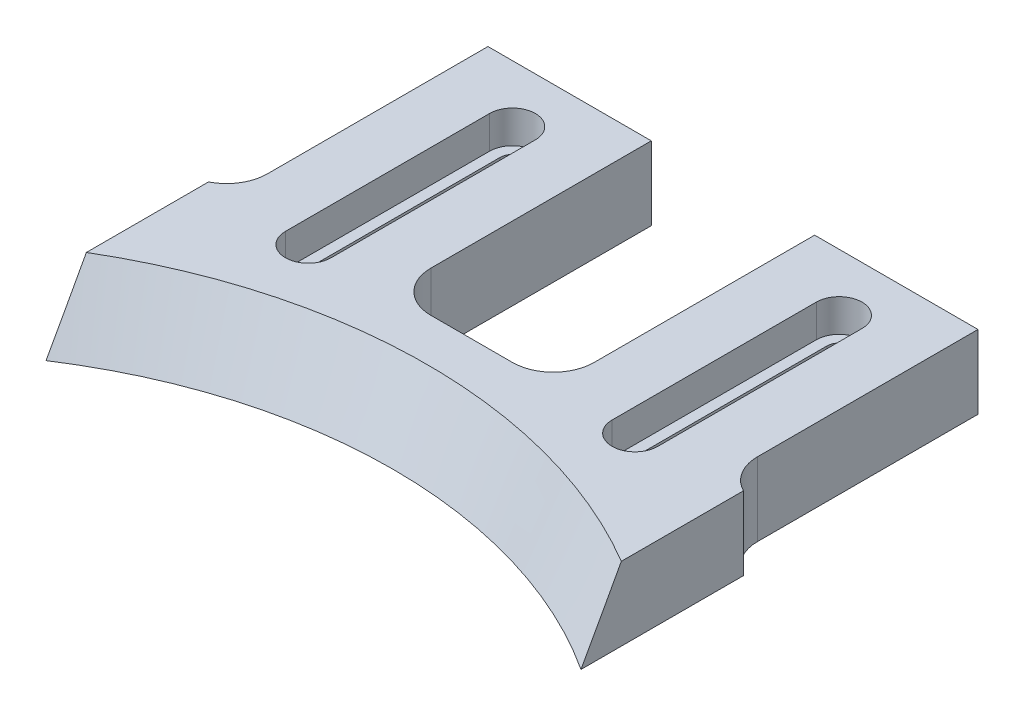
ISO-10303-21;
HEADER;
FILE_DESCRIPTION(('STEP AP214'),'2;1');
FILE_NAME('part.step','',(''),(''),'','','');
FILE_SCHEMA(('AUTOMOTIVE_DESIGN { 1 0 10303 214 1 1 1 1 }'));
ENDSEC;
DATA;
#1=APPLICATION_CONTEXT('core data for automotive mechanical design processes');
#2=APPLICATION_PROTOCOL_DEFINITION('international standard','automotive_design',2000,#1);
#3=PRODUCT_CONTEXT('',#1,'mechanical');
#4=PRODUCT('Part','Part','',(#3));
#5=PRODUCT_RELATED_PRODUCT_CATEGORY('part','',(#4));
#6=PRODUCT_DEFINITION_FORMATION('','',#4);
#7=PRODUCT_DEFINITION_CONTEXT('part definition',#1,'design');
#8=PRODUCT_DEFINITION('design','',#6,#7);
#9=PRODUCT_DEFINITION_SHAPE('','',#8);
#10=(LENGTH_UNIT() NAMED_UNIT(*) SI_UNIT(.MILLI.,.METRE.));
#11=(NAMED_UNIT(*) PLANE_ANGLE_UNIT() SI_UNIT($,.RADIAN.));
#12=(NAMED_UNIT(*) SI_UNIT($,.STERADIAN.) SOLID_ANGLE_UNIT());
#13=UNCERTAINTY_MEASURE_WITH_UNIT(LENGTH_MEASURE(1.E-05),#10,'distance_accuracy_value','');
#14=(GEOMETRIC_REPRESENTATION_CONTEXT(3) GLOBAL_UNCERTAINTY_ASSIGNED_CONTEXT((#13)) GLOBAL_UNIT_ASSIGNED_CONTEXT((#10,
#11,#12)) REPRESENTATION_CONTEXT('',''));
#15=CARTESIAN_POINT('',(0.,0.,0.));
#16=DIRECTION('',(0.,0.,1.));
#17=DIRECTION('',(1.,0.,0.));
#18=AXIS2_PLACEMENT_3D('',#15,#16,#17);
#19=CARTESIAN_POINT('',(57.75,-0.000999999999999265,-48.));
#20=DIRECTION('',(0.,1.,0.));
#21=DIRECTION('',(0.,0.,1.));
#22=AXIS2_PLACEMENT_3D('',#19,#20,#21);
#23=CYLINDRICAL_SURFACE('',#22,1.5);
#24=CARTESIAN_POINT('',(57.75,5.,-48.));
#25=DIRECTION('',(0.,1.,0.));
#26=DIRECTION('',(0.,0.,1.));
#27=AXIS2_PLACEMENT_3D('',#24,#25,#26);
#28=CIRCLE('',#27,1.5);
#29=CARTESIAN_POINT('',(56.25,5.,-48.));
#30=VERTEX_POINT('',#29);
#31=CARTESIAN_POINT('',(59.25,5.,-48.));
#32=VERTEX_POINT('',#31);
#33=EDGE_CURVE('E314',#30,#32,#28,.F.);
#34=ORIENTED_EDGE('',*,*,#33,.F.);
#35=DIRECTION('',(0.,1.,0.));
#36=VECTOR('',#35,1.);
#37=CARTESIAN_POINT('',(56.25,-0.000999999999999265,-48.));
#38=LINE('',#37,#36);
#39=CARTESIAN_POINT('',(56.25,0.,-48.));
#40=VERTEX_POINT('',#39);
#41=EDGE_CURVE('E324',#40,#30,#38,.T.);
#42=ORIENTED_EDGE('',*,*,#41,.F.);
#43=CARTESIAN_POINT('',(57.75,0.,-48.));
#44=DIRECTION('',(0.,-1.,0.));
#45=DIRECTION('',(0.,0.,-1.));
#46=AXIS2_PLACEMENT_3D('',#43,#44,#45);
#47=CIRCLE('',#46,1.5);
#48=CARTESIAN_POINT('',(59.25,0.,-48.));
#49=VERTEX_POINT('',#48);
#50=EDGE_CURVE('E335',#49,#40,#47,.F.);
#51=ORIENTED_EDGE('',*,*,#50,.F.);
#52=DIRECTION('',(0.,1.,0.));
#53=VECTOR('',#52,1.);
#54=CARTESIAN_POINT('',(59.25,-0.000999999999999265,-48.));
#55=LINE('',#54,#53);
#56=EDGE_CURVE('E327',#49,#32,#55,.T.);
#57=ORIENTED_EDGE('',*,*,#56,.T.);
#58=EDGE_LOOP('',(#34,#42,#51,#57));
#59=FACE_BOUND('',#58,.T.);
#60=ADVANCED_FACE('F37',(#59),#23,.F.);
#61=CARTESIAN_POINT('',(59.25,-0.000999999999999265,-48.));
#62=DIRECTION('',(1.,0.,0.));
#63=DIRECTION('',(0.,0.,-1.));
#64=AXIS2_PLACEMENT_3D('',#61,#62,#63);
#65=PLANE('',#64);
#66=DIRECTION('',(0.,0.,1.));
#67=VECTOR('',#66,1.);
#68=CARTESIAN_POINT('',(59.25,5.,-48.));
#69=LINE('',#68,#67);
#70=CARTESIAN_POINT('',(59.25,5.,-23.));
#71=VERTEX_POINT('',#70);
#72=EDGE_CURVE('E329',#32,#71,#69,.T.);
#73=ORIENTED_EDGE('',*,*,#72,.F.);
#74=ORIENTED_EDGE('',*,*,#56,.F.);
#75=DIRECTION('',(0.,0.,-1.));
#76=VECTOR('',#75,1.);
#77=CARTESIAN_POINT('',(59.25,0.,-48.));
#78=LINE('',#77,#76);
#79=CARTESIAN_POINT('',(59.25,0.,-23.));
#80=VERTEX_POINT('',#79);
#81=EDGE_CURVE('E339',#80,#49,#78,.T.);
#82=ORIENTED_EDGE('',*,*,#81,.F.);
#83=DIRECTION('',(0.,1.,0.));
#84=VECTOR('',#83,1.);
#85=CARTESIAN_POINT('',(59.25,-0.000999999999999265,-23.));
#86=LINE('',#85,#84);
#87=EDGE_CURVE('E337',#80,#71,#86,.T.);
#88=ORIENTED_EDGE('',*,*,#87,.T.);
#89=EDGE_LOOP('',(#73,#74,#82,#88));
#90=FACE_BOUND('',#89,.T.);
#91=ADVANCED_FACE('F425',(#90),#65,.F.);
#92=CARTESIAN_POINT('',(57.75,-0.000999999999999265,-23.));
#93=DIRECTION('',(0.,1.,0.));
#94=DIRECTION('',(0.,0.,1.));
#95=AXIS2_PLACEMENT_3D('',#92,#93,#94);
#96=CYLINDRICAL_SURFACE('',#95,1.49999999999999);
#97=CARTESIAN_POINT('',(57.75,5.,-23.));
#98=DIRECTION('',(0.,1.,0.));
#99=DIRECTION('',(0.,0.,1.));
#100=AXIS2_PLACEMENT_3D('',#97,#98,#99);
#101=CIRCLE('',#100,1.49999999999999);
#102=CARTESIAN_POINT('',(56.25,5.,-23.));
#103=VERTEX_POINT('',#102);
#104=EDGE_CURVE('E317',#71,#103,#101,.F.);
#105=ORIENTED_EDGE('',*,*,#104,.F.);
#106=ORIENTED_EDGE('',*,*,#87,.F.);
#107=CARTESIAN_POINT('',(57.75,0.,-23.));
#108=DIRECTION('',(0.,-1.,0.));
#109=DIRECTION('',(0.,0.,-1.));
#110=AXIS2_PLACEMENT_3D('',#107,#108,#109);
#111=CIRCLE('',#110,1.49999999999999);
#112=CARTESIAN_POINT('',(56.25,0.,-23.));
#113=VERTEX_POINT('',#112);
#114=EDGE_CURVE('E415',#113,#80,#111,.F.);
#115=ORIENTED_EDGE('',*,*,#114,.F.);
#116=DIRECTION('',(0.,1.,0.));
#117=VECTOR('',#116,1.);
#118=CARTESIAN_POINT('',(56.25,-0.000999999999999265,-23.));
#119=LINE('',#118,#117);
#120=EDGE_CURVE('E334',#113,#103,#119,.T.);
#121=ORIENTED_EDGE('',*,*,#120,.T.);
#122=EDGE_LOOP('',(#105,#106,#115,#121));
#123=FACE_BOUND('',#122,.T.);
#124=ADVANCED_FACE('F428',(#123),#96,.F.);
#125=CARTESIAN_POINT('',(56.25,-0.000999999999999265,-48.));
#126=DIRECTION('',(-1.,0.,0.));
#127=DIRECTION('',(0.,0.,1.));
#128=AXIS2_PLACEMENT_3D('',#125,#126,#127);
#129=PLANE('',#128);
#130=DIRECTION('',(0.,0.,-1.));
#131=VECTOR('',#130,1.);
#132=CARTESIAN_POINT('',(56.25,5.,-48.));
#133=LINE('',#132,#131);
#134=EDGE_CURVE('E45',#103,#30,#133,.T.);
#135=ORIENTED_EDGE('',*,*,#134,.F.);
#136=ORIENTED_EDGE('',*,*,#120,.F.);
#137=DIRECTION('',(0.,0.,1.));
#138=VECTOR('',#137,1.);
#139=CARTESIAN_POINT('',(56.25,0.,-48.));
#140=LINE('',#139,#138);
#141=EDGE_CURVE('E333',#40,#113,#140,.T.);
#142=ORIENTED_EDGE('',*,*,#141,.F.);
#143=ORIENTED_EDGE('',*,*,#41,.T.);
#144=EDGE_LOOP('',(#135,#136,#142,#143));
#145=FACE_BOUND('',#144,.T.);
#146=ADVANCED_FACE('F331',(#145),#129,.F.);
#147=CARTESIAN_POINT('',(17.75,-0.000999999999999265,-48.));
#148=DIRECTION('',(0.,1.,0.));
#149=DIRECTION('',(0.,0.,1.));
#150=AXIS2_PLACEMENT_3D('',#147,#148,#149);
#151=CYLINDRICAL_SURFACE('',#150,1.5);
#152=CARTESIAN_POINT('',(17.75,5.,-48.));
#153=DIRECTION('',(0.,1.,0.));
#154=DIRECTION('',(0.,0.,1.));
#155=AXIS2_PLACEMENT_3D('',#152,#153,#154);
#156=CIRCLE('',#155,1.5);
#157=CARTESIAN_POINT('',(16.25,5.,-48.));
#158=VERTEX_POINT('',#157);
#159=CARTESIAN_POINT('',(19.25,5.,-48.));
#160=VERTEX_POINT('',#159);
#161=EDGE_CURVE('E371',#158,#160,#156,.F.);
#162=ORIENTED_EDGE('',*,*,#161,.F.);
#163=DIRECTION('',(0.,1.,0.));
#164=VECTOR('',#163,1.);
#165=CARTESIAN_POINT('',(16.25,-0.000999999999999265,-48.));
#166=LINE('',#165,#164);
#167=CARTESIAN_POINT('',(16.25,0.,-48.));
#168=VERTEX_POINT('',#167);
#169=EDGE_CURVE('E353',#168,#158,#166,.T.);
#170=ORIENTED_EDGE('',*,*,#169,.F.);
#171=CARTESIAN_POINT('',(17.75,0.,-48.));
#172=DIRECTION('',(0.,-1.,0.));
#173=DIRECTION('',(0.,0.,-1.));
#174=AXIS2_PLACEMENT_3D('',#171,#172,#173);
#175=CIRCLE('',#174,1.5);
#176=CARTESIAN_POINT('',(19.25,0.,-48.));
#177=VERTEX_POINT('',#176);
#178=EDGE_CURVE('E350',#177,#168,#175,.F.);
#179=ORIENTED_EDGE('',*,*,#178,.F.);
#180=DIRECTION('',(0.,1.,0.));
#181=VECTOR('',#180,1.);
#182=CARTESIAN_POINT('',(19.25,-0.000999999999999265,-48.));
#183=LINE('',#182,#181);
#184=EDGE_CURVE('E259',#177,#160,#183,.T.);
#185=ORIENTED_EDGE('',*,*,#184,.T.);
#186=EDGE_LOOP('',(#162,#170,#179,#185));
#187=FACE_BOUND('',#186,.T.);
#188=ADVANCED_FACE('F369',(#187),#151,.F.);
#189=CARTESIAN_POINT('',(19.25,-0.000999999999999265,-48.));
#190=DIRECTION('',(1.,0.,0.));
#191=DIRECTION('',(0.,0.,-1.));
#192=AXIS2_PLACEMENT_3D('',#189,#190,#191);
#193=PLANE('',#192);
#194=DIRECTION('',(0.,0.,1.));
#195=VECTOR('',#194,1.);
#196=CARTESIAN_POINT('',(19.25,5.,-48.));
#197=LINE('',#196,#195);
#198=CARTESIAN_POINT('',(19.25,5.,-23.));
#199=VERTEX_POINT('',#198);
#200=EDGE_CURVE('E383',#160,#199,#197,.T.);
#201=ORIENTED_EDGE('',*,*,#200,.F.);
#202=ORIENTED_EDGE('',*,*,#184,.F.);
#203=DIRECTION('',(0.,0.,-1.));
#204=VECTOR('',#203,1.);
#205=CARTESIAN_POINT('',(19.25,0.,-48.));
#206=LINE('',#205,#204);
#207=CARTESIAN_POINT('',(19.25,0.,-23.));
#208=VERTEX_POINT('',#207);
#209=EDGE_CURVE('E347',#208,#177,#206,.T.);
#210=ORIENTED_EDGE('',*,*,#209,.F.);
#211=DIRECTION('',(0.,1.,0.));
#212=VECTOR('',#211,1.);
#213=CARTESIAN_POINT('',(19.25,-0.000999999999999265,-23.));
#214=LINE('',#213,#212);
#215=EDGE_CURVE('E356',#208,#199,#214,.T.);
#216=ORIENTED_EDGE('',*,*,#215,.T.);
#217=EDGE_LOOP('',(#201,#202,#210,#216));
#218=FACE_BOUND('',#217,.T.);
#219=ADVANCED_FACE('F377',(#218),#193,.F.);
#220=CARTESIAN_POINT('',(17.75,-0.000999999999999265,-23.));
#221=DIRECTION('',(0.,1.,0.));
#222=DIRECTION('',(0.,0.,1.));
#223=AXIS2_PLACEMENT_3D('',#220,#221,#222);
#224=CYLINDRICAL_SURFACE('',#223,1.5);
#225=CARTESIAN_POINT('',(17.75,5.,-23.));
#226=DIRECTION('',(0.,1.,0.));
#227=DIRECTION('',(0.,0.,1.));
#228=AXIS2_PLACEMENT_3D('',#225,#226,#227);
#229=CIRCLE('',#228,1.5);
#230=CARTESIAN_POINT('',(16.25,5.,-23.));
#231=VERTEX_POINT('',#230);
#232=EDGE_CURVE('E381',#199,#231,#229,.F.);
#233=ORIENTED_EDGE('',*,*,#232,.F.);
#234=ORIENTED_EDGE('',*,*,#215,.F.);
#235=CARTESIAN_POINT('',(17.75,0.,-23.));
#236=DIRECTION('',(0.,-1.,0.));
#237=DIRECTION('',(0.,0.,-1.));
#238=AXIS2_PLACEMENT_3D('',#235,#236,#237);
#239=CIRCLE('',#238,1.5);
#240=CARTESIAN_POINT('',(16.25,0.,-23.));
#241=VERTEX_POINT('',#240);
#242=EDGE_CURVE('E344',#241,#208,#239,.F.);
#243=ORIENTED_EDGE('',*,*,#242,.F.);
#244=DIRECTION('',(0.,1.,0.));
#245=VECTOR('',#244,1.);
#246=CARTESIAN_POINT('',(16.25,-0.000999999999999265,-23.));
#247=LINE('',#246,#245);
#248=EDGE_CURVE('E359',#241,#231,#247,.T.);
#249=ORIENTED_EDGE('',*,*,#248,.T.);
#250=EDGE_LOOP('',(#233,#234,#243,#249));
#251=FACE_BOUND('',#250,.T.);
#252=ADVANCED_FACE('F380',(#251),#224,.F.);
#253=CARTESIAN_POINT('',(16.25,-0.000999999999999265,-48.));
#254=DIRECTION('',(-1.,0.,0.));
#255=DIRECTION('',(0.,0.,1.));
#256=AXIS2_PLACEMENT_3D('',#253,#254,#255);
#257=PLANE('',#256);
#258=DIRECTION('',(0.,0.,-1.));
#259=VECTOR('',#258,1.);
#260=CARTESIAN_POINT('',(16.25,5.,-48.));
#261=LINE('',#260,#259);
#262=EDGE_CURVE('E309',#231,#158,#261,.T.);
#263=ORIENTED_EDGE('',*,*,#262,.F.);
#264=ORIENTED_EDGE('',*,*,#248,.F.);
#265=DIRECTION('',(0.,0.,1.));
#266=VECTOR('',#265,1.);
#267=CARTESIAN_POINT('',(16.25,0.,-48.));
#268=LINE('',#267,#266);
#269=EDGE_CURVE('E253',#168,#241,#268,.T.);
#270=ORIENTED_EDGE('',*,*,#269,.F.);
#271=ORIENTED_EDGE('',*,*,#169,.T.);
#272=EDGE_LOOP('',(#263,#264,#270,#271));
#273=FACE_BOUND('',#272,.T.);
#274=ADVANCED_FACE('F366',(#273),#257,.F.);
#275=CARTESIAN_POINT('',(0.,9.,-55.));
#276=DIRECTION('',(0.,0.,1.));
#277=DIRECTION('',(1.,0.,0.));
#278=AXIS2_PLACEMENT_3D('',#275,#276,#277);
#279=PLANE('',#278);
#280=DIRECTION('',(-1.,0.,0.));
#281=VECTOR('',#280,1.);
#282=CARTESIAN_POINT('',(0.,0.,-55.));
#283=LINE('',#282,#281);
#284=CARTESIAN_POINT('',(27.75,0.,-55.));
#285=VERTEX_POINT('',#284);
#286=CARTESIAN_POINT('',(7.74999999999998,0.,-55.));
#287=VERTEX_POINT('',#286);
#288=EDGE_CURVE('E252',#285,#287,#283,.T.);
#289=ORIENTED_EDGE('',*,*,#288,.T.);
#290=DIRECTION('',(0.,1.,0.));
#291=VECTOR('',#290,1.);
#292=CARTESIAN_POINT('',(7.74999999999998,-1.,-55.));
#293=LINE('',#292,#291);
#294=CARTESIAN_POINT('',(7.74999999999998,9.,-55.));
#295=VERTEX_POINT('',#294);
#296=EDGE_CURVE('E401',#287,#295,#293,.T.);
#297=ORIENTED_EDGE('',*,*,#296,.T.);
#298=DIRECTION('',(-1.,0.,0.));
#299=VECTOR('',#298,1.);
#300=CARTESIAN_POINT('',(0.,9.,-55.));
#301=LINE('',#300,#299);
#302=CARTESIAN_POINT('',(27.75,9.,-55.));
#303=VERTEX_POINT('',#302);
#304=EDGE_CURVE('E264',#303,#295,#301,.T.);
#305=ORIENTED_EDGE('',*,*,#304,.F.);
#306=DIRECTION('',(0.,1.,0.));
#307=VECTOR('',#306,1.);
#308=CARTESIAN_POINT('',(27.75,-1.,-55.));
#309=LINE('',#308,#307);
#310=EDGE_CURVE('E413',#285,#303,#309,.T.);
#311=ORIENTED_EDGE('',*,*,#310,.F.);
#312=EDGE_LOOP('',(#289,#297,#305,#311));
#313=FACE_BOUND('',#312,.T.);
#314=ADVANCED_FACE('F459',(#313),#279,.F.);
#315=CARTESIAN_POINT('',(67.75,9.,-55.));
#316=VERTEX_POINT('',#315);
#317=CARTESIAN_POINT('',(47.75,9.,-55.));
#318=VERTEX_POINT('',#317);
#319=EDGE_CURVE('E262',#316,#318,#301,.T.);
#320=ORIENTED_EDGE('',*,*,#319,.F.);
#321=DIRECTION('',(0.,1.,0.));
#322=VECTOR('',#321,1.);
#323=CARTESIAN_POINT('',(67.75,-1.,-55.));
#324=LINE('',#323,#322);
#325=CARTESIAN_POINT('',(67.75,0.,-55.));
#326=VERTEX_POINT('',#325);
#327=EDGE_CURVE('E397',#326,#316,#324,.T.);
#328=ORIENTED_EDGE('',*,*,#327,.F.);
#329=CARTESIAN_POINT('',(47.75,0.,-55.));
#330=VERTEX_POINT('',#329);
#331=EDGE_CURVE('E256',#326,#330,#283,.T.);
#332=ORIENTED_EDGE('',*,*,#331,.T.);
#333=DIRECTION('',(0.,1.,0.));
#334=VECTOR('',#333,1.);
#335=CARTESIAN_POINT('',(47.75,-1.,-55.));
#336=LINE('',#335,#334);
#337=EDGE_CURVE('E412',#330,#318,#336,.T.);
#338=ORIENTED_EDGE('',*,*,#337,.T.);
#339=EDGE_LOOP('',(#320,#328,#332,#338));
#340=FACE_BOUND('',#339,.T.);
#341=ADVANCED_FACE('F440',(#340),#279,.F.);
#342=CARTESIAN_POINT('',(37.75,9.,46.636225190296));
#343=DIRECTION('',(0.,-1.,0.));
#344=DIRECTION('',(0.,0.,-1.));
#345=AXIS2_PLACEMENT_3D('',#342,#343,#344);
#346=PLANE('',#345);
#347=DIRECTION('',(0.,0.,1.));
#348=VECTOR('',#347,1.);
#349=CARTESIAN_POINT('',(54.95,9.,-48.));
#350=LINE('',#349,#348);
#351=CARTESIAN_POINT('',(54.95,9.,-48.));
#352=VERTEX_POINT('',#351);
#353=CARTESIAN_POINT('',(54.95,9.,-23.));
#354=VERTEX_POINT('',#353);
#355=EDGE_CURVE('E559',#352,#354,#350,.T.);
#356=ORIENTED_EDGE('',*,*,#355,.F.);
#357=CARTESIAN_POINT('',(57.75,9.,-48.));
#358=DIRECTION('',(0.,1.,0.));
#359=DIRECTION('',(0.,0.,1.));
#360=AXIS2_PLACEMENT_3D('',#357,#358,#359);
#361=CIRCLE('',#360,2.8);
#362=CARTESIAN_POINT('',(60.55,9.,-48.));
#363=VERTEX_POINT('',#362);
#364=EDGE_CURVE('E543',#363,#352,#361,.T.);
#365=ORIENTED_EDGE('',*,*,#364,.F.);
#366=DIRECTION('',(0.,0.,-1.));
#367=VECTOR('',#366,1.);
#368=CARTESIAN_POINT('',(60.55,9.,-48.));
#369=LINE('',#368,#367);
#370=CARTESIAN_POINT('',(60.55,9.,-23.));
#371=VERTEX_POINT('',#370);
#372=EDGE_CURVE('E548',#371,#363,#369,.T.);
#373=ORIENTED_EDGE('',*,*,#372,.F.);
#374=CARTESIAN_POINT('',(57.75,9.,-23.));
#375=DIRECTION('',(0.,1.,0.));
#376=DIRECTION('',(0.,0.,1.));
#377=AXIS2_PLACEMENT_3D('',#374,#375,#376);
#378=CIRCLE('',#377,2.79999999999999);
#379=EDGE_CURVE('E562',#354,#371,#378,.T.);
#380=ORIENTED_EDGE('',*,*,#379,.F.);
#381=EDGE_LOOP('',(#356,#365,#373,#380));
#382=FACE_BOUND('',#381,.T.);
#383=DIRECTION('',(0.,0.,1.));
#384=VECTOR('',#383,1.);
#385=CARTESIAN_POINT('',(14.95,9.,-48.));
#386=LINE('',#385,#384);
#387=CARTESIAN_POINT('',(14.95,9.,-48.));
#388=VERTEX_POINT('',#387);
#389=CARTESIAN_POINT('',(14.95,9.,-23.));
#390=VERTEX_POINT('',#389);
#391=EDGE_CURVE('E591',#388,#390,#386,.T.);
#392=ORIENTED_EDGE('',*,*,#391,.F.);
#393=CARTESIAN_POINT('',(17.75,9.,-48.));
#394=DIRECTION('',(0.,1.,0.));
#395=DIRECTION('',(0.,0.,1.));
#396=AXIS2_PLACEMENT_3D('',#393,#394,#395);
#397=CIRCLE('',#396,2.8);
#398=CARTESIAN_POINT('',(20.55,9.,-48.));
#399=VERTEX_POINT('',#398);
#400=EDGE_CURVE('E328',#399,#388,#397,.T.);
#401=ORIENTED_EDGE('',*,*,#400,.F.);
#402=DIRECTION('',(0.,0.,-1.));
#403=VECTOR('',#402,1.);
#404=CARTESIAN_POINT('',(20.55,9.,-48.));
#405=LINE('',#404,#403);
#406=CARTESIAN_POINT('',(20.55,9.,-23.));
#407=VERTEX_POINT('',#406);
#408=EDGE_CURVE('E581',#407,#399,#405,.T.);
#409=ORIENTED_EDGE('',*,*,#408,.F.);
#410=CARTESIAN_POINT('',(17.75,9.,-23.));
#411=DIRECTION('',(0.,1.,0.));
#412=DIRECTION('',(0.,0.,1.));
#413=AXIS2_PLACEMENT_3D('',#410,#411,#412);
#414=CIRCLE('',#413,2.8);
#415=EDGE_CURVE('E594',#390,#407,#414,.T.);
#416=ORIENTED_EDGE('',*,*,#415,.F.);
#417=EDGE_LOOP('',(#392,#401,#409,#416));
#418=FACE_BOUND('',#417,.T.);
#419=CARTESIAN_POINT('',(37.75,9.,46.636225190296));
#420=DIRECTION('',(0.,-1.,0.));
#421=DIRECTION('',(0.,0.,-1.));
#422=AXIS2_PLACEMENT_3D('',#419,#420,#421);
#423=CIRCLE('',#422,64.196768923395);
#424=CARTESIAN_POINT('',(5.,9.,-8.57847068139897));
#425=VERTEX_POINT('',#424);
#426=CARTESIAN_POINT('',(70.5,9.,-8.57847068139898));
#427=VERTEX_POINT('',#426);
#428=EDGE_CURVE('E11',#425,#427,#423,.T.);
#429=ORIENTED_EDGE('',*,*,#428,.T.);
#430=DIRECTION('',(0.,0.,1.));
#431=VECTOR('',#430,1.);
#432=CARTESIAN_POINT('',(70.5,9.,0.));
#433=LINE('',#432,#431);
#434=CARTESIAN_POINT('',(70.5,9.,-23.5348572251271));
#435=VERTEX_POINT('',#434);
#436=EDGE_CURVE('E52',#435,#427,#433,.T.);
#437=ORIENTED_EDGE('',*,*,#436,.F.);
#438=CARTESIAN_POINT('',(72.75,9.,-28.));
#439=DIRECTION('',(0.,-1.,0.));
#440=DIRECTION('',(0.,0.,-1.));
#441=AXIS2_PLACEMENT_3D('',#438,#439,#440);
#442=CIRCLE('',#441,5.);
#443=CARTESIAN_POINT('',(67.75,9.,-28.));
#444=VERTEX_POINT('',#443);
#445=EDGE_CURVE('E293',#435,#444,#442,.T.);
#446=ORIENTED_EDGE('',*,*,#445,.T.);
#447=DIRECTION('',(0.,0.,1.));
#448=VECTOR('',#447,1.);
#449=CARTESIAN_POINT('',(67.75,9.,-55.));
#450=LINE('',#449,#448);
#451=EDGE_CURVE('E394',#316,#444,#450,.T.);
#452=ORIENTED_EDGE('',*,*,#451,.F.);
#453=ORIENTED_EDGE('',*,*,#319,.T.);
#454=DIRECTION('',(0.,0.,-1.));
#455=VECTOR('',#454,1.);
#456=CARTESIAN_POINT('',(47.75,9.,-55.));
#457=LINE('',#456,#455);
#458=CARTESIAN_POINT('',(47.75,9.,-28.));
#459=VERTEX_POINT('',#458);
#460=EDGE_CURVE('E410',#459,#318,#457,.T.);
#461=ORIENTED_EDGE('',*,*,#460,.F.);
#462=CARTESIAN_POINT('',(42.75,9.,-28.));
#463=DIRECTION('',(0.,-1.,0.));
#464=DIRECTION('',(0.,0.,-1.));
#465=AXIS2_PLACEMENT_3D('',#462,#463,#464);
#466=CIRCLE('',#465,5.);
#467=CARTESIAN_POINT('',(42.75,9.,-23.));
#468=VERTEX_POINT('',#467);
#469=EDGE_CURVE('E296',#459,#468,#466,.T.);
#470=ORIENTED_EDGE('',*,*,#469,.T.);
#471=DIRECTION('',(1.,0.,0.));
#472=VECTOR('',#471,1.);
#473=CARTESIAN_POINT('',(27.75,9.,-23.));
#474=LINE('',#473,#472);
#475=CARTESIAN_POINT('',(32.75,9.,-23.));
#476=VERTEX_POINT('',#475);
#477=EDGE_CURVE('E407',#476,#468,#474,.T.);
#478=ORIENTED_EDGE('',*,*,#477,.F.);
#479=CARTESIAN_POINT('',(32.75,9.,-28.));
#480=DIRECTION('',(0.,-1.,0.));
#481=DIRECTION('',(0.,0.,-1.));
#482=AXIS2_PLACEMENT_3D('',#479,#480,#481);
#483=CIRCLE('',#482,5.);
#484=CARTESIAN_POINT('',(27.75,9.,-28.));
#485=VERTEX_POINT('',#484);
#486=EDGE_CURVE('E300',#476,#485,#483,.T.);
#487=ORIENTED_EDGE('',*,*,#486,.T.);
#488=DIRECTION('',(0.,0.,1.));
#489=VECTOR('',#488,1.);
#490=CARTESIAN_POINT('',(27.75,9.,-55.));
#491=LINE('',#490,#489);
#492=EDGE_CURVE('E404',#303,#485,#491,.T.);
#493=ORIENTED_EDGE('',*,*,#492,.F.);
#494=ORIENTED_EDGE('',*,*,#304,.T.);
#495=DIRECTION('',(0.,0.,-1.));
#496=VECTOR('',#495,1.);
#497=CARTESIAN_POINT('',(7.74999999999998,9.,-55.));
#498=LINE('',#497,#496);
#499=CARTESIAN_POINT('',(7.74999999999998,9.,-28.));
#500=VERTEX_POINT('',#499);
#501=EDGE_CURVE('E399',#500,#295,#498,.T.);
#502=ORIENTED_EDGE('',*,*,#501,.F.);
#503=CARTESIAN_POINT('',(2.74999999999998,9.,-28.));
#504=DIRECTION('',(0.,-1.,0.));
#505=DIRECTION('',(0.,0.,-1.));
#506=AXIS2_PLACEMENT_3D('',#503,#504,#505);
#507=CIRCLE('',#506,5.);
#508=CARTESIAN_POINT('',(5.,9.,-23.5348572251271));
#509=VERTEX_POINT('',#508);
#510=EDGE_CURVE('E304',#500,#509,#507,.T.);
#511=ORIENTED_EDGE('',*,*,#510,.T.);
#512=DIRECTION('',(0.,0.,-1.));
#513=VECTOR('',#512,1.);
#514=CARTESIAN_POINT('',(5.,9.,0.));
#515=LINE('',#514,#513);
#516=EDGE_CURVE('E541',#425,#509,#515,.T.);
#517=ORIENTED_EDGE('',*,*,#516,.F.);
#518=EDGE_LOOP('',(#429,#437,#446,#452,#453,#461,#470,#478,#487,#493,#494,#502,#511,#517));
#519=FACE_BOUND('',#518,.T.);
#520=ADVANCED_FACE('F431',(#382,#418,#519),#346,.F.);
#521=CARTESIAN_POINT('',(37.75,0.,46.636225190296));
#522=DIRECTION('',(0.,-1.,0.));
#523=DIRECTION('',(0.,0.,-1.));
#524=AXIS2_PLACEMENT_3D('',#521,#522,#523);
#525=PLANE('',#524);
#526=DIRECTION('',(0.,0.,1.));
#527=VECTOR('',#526,1.);
#528=CARTESIAN_POINT('',(70.5,0.,0.));
#529=LINE('',#528,#527);
#530=CARTESIAN_POINT('',(70.5,0.,-23.5348572251271));
#531=VERTEX_POINT('',#530);
#532=CARTESIAN_POINT('',(70.5,0.,-3.63740109625707));
#533=VERTEX_POINT('',#532);
#534=EDGE_CURVE('E234',#531,#533,#529,.T.);
#535=ORIENTED_EDGE('',*,*,#534,.T.);
#536=CARTESIAN_POINT('',(37.75,0.,46.636225190296));
#537=DIRECTION('',(0.,-1.,0.));
#538=DIRECTION('',(0.,0.,-1.));
#539=AXIS2_PLACEMENT_3D('',#536,#537,#538);
#540=CIRCLE('',#539,60.);
#541=CARTESIAN_POINT('',(5.,0.,-3.63740109625706));
#542=VERTEX_POINT('',#541);
#543=EDGE_CURVE('E246',#542,#533,#540,.T.);
#544=ORIENTED_EDGE('',*,*,#543,.F.);
#545=DIRECTION('',(0.,0.,-1.));
#546=VECTOR('',#545,1.);
#547=CARTESIAN_POINT('',(5.,0.,0.));
#548=LINE('',#547,#546);
#549=CARTESIAN_POINT('',(5.,0.,-23.5348572251271));
#550=VERTEX_POINT('',#549);
#551=EDGE_CURVE('E60',#542,#550,#548,.T.);
#552=ORIENTED_EDGE('',*,*,#551,.T.);
#553=CARTESIAN_POINT('',(2.74999999999998,0.,-28.));
#554=DIRECTION('',(0.,-1.,0.));
#555=DIRECTION('',(0.,0.,-1.));
#556=AXIS2_PLACEMENT_3D('',#553,#554,#555);
#557=CIRCLE('',#556,5.);
#558=CARTESIAN_POINT('',(7.74999999999998,0.,-28.));
#559=VERTEX_POINT('',#558);
#560=EDGE_CURVE('E307',#550,#559,#557,.F.);
#561=ORIENTED_EDGE('',*,*,#560,.T.);
#562=DIRECTION('',(0.,0.,1.));
#563=VECTOR('',#562,1.);
#564=CARTESIAN_POINT('',(7.74999999999999,0.,46.636225190296));
#565=LINE('',#564,#563);
#566=EDGE_CURVE('E273',#287,#559,#565,.T.);
#567=ORIENTED_EDGE('',*,*,#566,.F.);
#568=ORIENTED_EDGE('',*,*,#288,.F.);
#569=DIRECTION('',(0.,0.,-1.));
#570=VECTOR('',#569,1.);
#571=CARTESIAN_POINT('',(27.75,0.,46.636225190296));
#572=LINE('',#571,#570);
#573=CARTESIAN_POINT('',(27.75,0.,-28.));
#574=VERTEX_POINT('',#573);
#575=EDGE_CURVE('E271',#574,#285,#572,.T.);
#576=ORIENTED_EDGE('',*,*,#575,.F.);
#577=CARTESIAN_POINT('',(32.75,0.,-28.));
#578=DIRECTION('',(0.,-1.,0.));
#579=DIRECTION('',(0.,0.,-1.));
#580=AXIS2_PLACEMENT_3D('',#577,#578,#579);
#581=CIRCLE('',#580,5.);
#582=CARTESIAN_POINT('',(32.75,0.,-23.));
#583=VERTEX_POINT('',#582);
#584=EDGE_CURVE('E302',#574,#583,#581,.F.);
#585=ORIENTED_EDGE('',*,*,#584,.T.);
#586=DIRECTION('',(-1.,0.,0.));
#587=VECTOR('',#586,1.);
#588=CARTESIAN_POINT('',(37.75,0.,-23.));
#589=LINE('',#588,#587);
#590=CARTESIAN_POINT('',(42.75,0.,-23.));
#591=VERTEX_POINT('',#590);
#592=EDGE_CURVE('E265',#591,#583,#589,.T.);
#593=ORIENTED_EDGE('',*,*,#592,.F.);
#594=CARTESIAN_POINT('',(42.75,0.,-28.));
#595=DIRECTION('',(0.,-1.,0.));
#596=DIRECTION('',(0.,0.,-1.));
#597=AXIS2_PLACEMENT_3D('',#594,#595,#596);
#598=CIRCLE('',#597,5.);
#599=CARTESIAN_POINT('',(47.75,0.,-28.));
#600=VERTEX_POINT('',#599);
#601=EDGE_CURVE('E298',#591,#600,#598,.F.);
#602=ORIENTED_EDGE('',*,*,#601,.T.);
#603=DIRECTION('',(0.,0.,1.));
#604=VECTOR('',#603,1.);
#605=CARTESIAN_POINT('',(47.75,0.,46.636225190296));
#606=LINE('',#605,#604);
#607=EDGE_CURVE('E268',#330,#600,#606,.T.);
#608=ORIENTED_EDGE('',*,*,#607,.F.);
#609=ORIENTED_EDGE('',*,*,#331,.F.);
#610=DIRECTION('',(0.,0.,-1.));
#611=VECTOR('',#610,1.);
#612=CARTESIAN_POINT('',(67.75,0.,46.636225190296));
#613=LINE('',#612,#611);
#614=CARTESIAN_POINT('',(67.75,0.,-28.));
#615=VERTEX_POINT('',#614);
#616=EDGE_CURVE('E276',#615,#326,#613,.T.);
#617=ORIENTED_EDGE('',*,*,#616,.F.);
#618=CARTESIAN_POINT('',(72.75,0.,-28.));
#619=DIRECTION('',(0.,-1.,0.));
#620=DIRECTION('',(0.,0.,-1.));
#621=AXIS2_PLACEMENT_3D('',#618,#619,#620);
#622=CIRCLE('',#621,5.);
#623=EDGE_CURVE('E249',#615,#531,#622,.F.);
#624=ORIENTED_EDGE('',*,*,#623,.T.);
#625=EDGE_LOOP('',(#535,#544,#552,#561,#567,#568,#576,#585,#593,#602,#608,#609,#617,#624));
#626=FACE_BOUND('',#625,.T.);
#627=ORIENTED_EDGE('',*,*,#50,.T.);
#628=ORIENTED_EDGE('',*,*,#141,.T.);
#629=ORIENTED_EDGE('',*,*,#114,.T.);
#630=ORIENTED_EDGE('',*,*,#81,.T.);
#631=EDGE_LOOP('',(#627,#628,#629,#630));
#632=FACE_BOUND('',#631,.T.);
#633=ORIENTED_EDGE('',*,*,#178,.T.);
#634=ORIENTED_EDGE('',*,*,#269,.T.);
#635=ORIENTED_EDGE('',*,*,#242,.T.);
#636=ORIENTED_EDGE('',*,*,#209,.T.);
#637=EDGE_LOOP('',(#633,#634,#635,#636));
#638=FACE_BOUND('',#637,.T.);
#639=ADVANCED_FACE('F244',(#626,#632,#638),#525,.T.);
#640=CARTESIAN_POINT('',(27.75,-1.,-55.));
#641=DIRECTION('',(-1.,0.,0.));
#642=DIRECTION('',(0.,0.,1.));
#643=AXIS2_PLACEMENT_3D('',#640,#641,#642);
#644=PLANE('',#643);
#645=ORIENTED_EDGE('',*,*,#492,.T.);
#646=DIRECTION('',(0.,1.,0.));
#647=VECTOR('',#646,1.);
#648=CARTESIAN_POINT('',(27.75,0.,-28.));
#649=LINE('',#648,#647);
#650=EDGE_CURVE('E288',#485,#574,#649,.F.);
#651=ORIENTED_EDGE('',*,*,#650,.T.);
#652=ORIENTED_EDGE('',*,*,#575,.T.);
#653=ORIENTED_EDGE('',*,*,#310,.T.);
#654=EDGE_LOOP('',(#645,#651,#652,#653));
#655=FACE_BOUND('',#654,.T.);
#656=ADVANCED_FACE('F430',(#655),#644,.F.);
#657=CARTESIAN_POINT('',(47.75,-1.,-55.));
#658=DIRECTION('',(1.,0.,0.));
#659=DIRECTION('',(0.,0.,-1.));
#660=AXIS2_PLACEMENT_3D('',#657,#658,#659);
#661=PLANE('',#660);
#662=ORIENTED_EDGE('',*,*,#607,.T.);
#663=DIRECTION('',(0.,1.,0.));
#664=VECTOR('',#663,1.);
#665=CARTESIAN_POINT('',(47.75,9.,-28.));
#666=LINE('',#665,#664);
#667=EDGE_CURVE('E280',#600,#459,#666,.T.);
#668=ORIENTED_EDGE('',*,*,#667,.T.);
#669=ORIENTED_EDGE('',*,*,#460,.T.);
#670=ORIENTED_EDGE('',*,*,#337,.F.);
#671=EDGE_LOOP('',(#662,#668,#669,#670));
#672=FACE_BOUND('',#671,.T.);
#673=ADVANCED_FACE('F437',(#672),#661,.F.);
#674=CARTESIAN_POINT('',(27.75,-1.,-23.));
#675=DIRECTION('',(0.,0.,1.));
#676=DIRECTION('',(1.,0.,0.));
#677=AXIS2_PLACEMENT_3D('',#674,#675,#676);
#678=PLANE('',#677);
#679=ORIENTED_EDGE('',*,*,#477,.T.);
#680=DIRECTION('',(0.,1.,0.));
#681=VECTOR('',#680,1.);
#682=CARTESIAN_POINT('',(42.75,0.,-23.));
#683=LINE('',#682,#681);
#684=EDGE_CURVE('E286',#468,#591,#683,.F.);
#685=ORIENTED_EDGE('',*,*,#684,.T.);
#686=ORIENTED_EDGE('',*,*,#592,.T.);
#687=DIRECTION('',(0.,1.,0.));
#688=VECTOR('',#687,1.);
#689=CARTESIAN_POINT('',(32.75,9.,-23.));
#690=LINE('',#689,#688);
#691=EDGE_CURVE('E283',#583,#476,#690,.T.);
#692=ORIENTED_EDGE('',*,*,#691,.T.);
#693=EDGE_LOOP('',(#679,#685,#686,#692));
#694=FACE_BOUND('',#693,.T.);
#695=ADVANCED_FACE('F470',(#694),#678,.F.);
#696=CARTESIAN_POINT('',(7.74999999999998,-1.,-55.));
#697=DIRECTION('',(1.,0.,0.));
#698=DIRECTION('',(0.,0.,-1.));
#699=AXIS2_PLACEMENT_3D('',#696,#697,#698);
#700=PLANE('',#699);
#701=ORIENTED_EDGE('',*,*,#566,.T.);
#702=DIRECTION('',(0.,1.,0.));
#703=VECTOR('',#702,1.);
#704=CARTESIAN_POINT('',(7.74999999999998,9.,-28.));
#705=LINE('',#704,#703);
#706=EDGE_CURVE('E290',#559,#500,#705,.T.);
#707=ORIENTED_EDGE('',*,*,#706,.T.);
#708=ORIENTED_EDGE('',*,*,#501,.T.);
#709=ORIENTED_EDGE('',*,*,#296,.F.);
#710=EDGE_LOOP('',(#701,#707,#708,#709));
#711=FACE_BOUND('',#710,.T.);
#712=ADVANCED_FACE('F473',(#711),#700,.F.);
#713=CARTESIAN_POINT('',(67.75,-1.,-55.));
#714=DIRECTION('',(-1.,0.,0.));
#715=DIRECTION('',(0.,0.,1.));
#716=AXIS2_PLACEMENT_3D('',#713,#714,#715);
#717=PLANE('',#716);
#718=ORIENTED_EDGE('',*,*,#451,.T.);
#719=DIRECTION('',(0.,1.,0.));
#720=VECTOR('',#719,1.);
#721=CARTESIAN_POINT('',(67.75,0.,-28.));
#722=LINE('',#721,#720);
#723=EDGE_CURVE('E278',#444,#615,#722,.F.);
#724=ORIENTED_EDGE('',*,*,#723,.T.);
#725=ORIENTED_EDGE('',*,*,#616,.T.);
#726=ORIENTED_EDGE('',*,*,#327,.T.);
#727=EDGE_LOOP('',(#718,#724,#725,#726));
#728=FACE_BOUND('',#727,.T.);
#729=ADVANCED_FACE('F480',(#728),#717,.F.);
#730=CARTESIAN_POINT('',(72.75,-1.,-28.));
#731=DIRECTION('',(0.,-1.,0.));
#732=DIRECTION('',(0.,0.,-1.));
#733=AXIS2_PLACEMENT_3D('',#730,#731,#732);
#734=CYLINDRICAL_SURFACE('',#733,5.);
#735=ORIENTED_EDGE('',*,*,#445,.F.);
#736=DIRECTION('',(0.,-1.,0.));
#737=VECTOR('',#736,1.);
#738=CARTESIAN_POINT('',(70.5,-1.,-23.5348572251271));
#739=LINE('',#738,#737);
#740=EDGE_CURVE('E239',#531,#435,#739,.F.);
#741=ORIENTED_EDGE('',*,*,#740,.F.);
#742=ORIENTED_EDGE('',*,*,#623,.F.);
#743=ORIENTED_EDGE('',*,*,#723,.F.);
#744=EDGE_LOOP('',(#735,#741,#742,#743));
#745=FACE_BOUND('',#744,.T.);
#746=ADVANCED_FACE('F484',(#745),#734,.F.);
#747=CARTESIAN_POINT('',(42.75,-1.,-28.));
#748=DIRECTION('',(0.,-1.,0.));
#749=DIRECTION('',(0.,0.,-1.));
#750=AXIS2_PLACEMENT_3D('',#747,#748,#749);
#751=CYLINDRICAL_SURFACE('',#750,5.);
#752=ORIENTED_EDGE('',*,*,#601,.F.);
#753=ORIENTED_EDGE('',*,*,#684,.F.);
#754=ORIENTED_EDGE('',*,*,#469,.F.);
#755=ORIENTED_EDGE('',*,*,#667,.F.);
#756=EDGE_LOOP('',(#752,#753,#754,#755));
#757=FACE_BOUND('',#756,.T.);
#758=ADVANCED_FACE('F639',(#757),#751,.F.);
#759=CARTESIAN_POINT('',(32.75,-1.,-28.));
#760=DIRECTION('',(0.,-1.,0.));
#761=DIRECTION('',(0.,0.,-1.));
#762=AXIS2_PLACEMENT_3D('',#759,#760,#761);
#763=CYLINDRICAL_SURFACE('',#762,5.);
#764=ORIENTED_EDGE('',*,*,#584,.F.);
#765=ORIENTED_EDGE('',*,*,#650,.F.);
#766=ORIENTED_EDGE('',*,*,#486,.F.);
#767=ORIENTED_EDGE('',*,*,#691,.F.);
#768=EDGE_LOOP('',(#764,#765,#766,#767));
#769=FACE_BOUND('',#768,.T.);
#770=ADVANCED_FACE('F644',(#769),#763,.F.);
#771=CARTESIAN_POINT('',(2.74999999999998,-1.,-28.));
#772=DIRECTION('',(0.,-1.,0.));
#773=DIRECTION('',(0.,0.,-1.));
#774=AXIS2_PLACEMENT_3D('',#771,#772,#773);
#775=CYLINDRICAL_SURFACE('',#774,5.);
#776=ORIENTED_EDGE('',*,*,#560,.F.);
#777=DIRECTION('',(0.,-1.,0.));
#778=VECTOR('',#777,1.);
#779=CARTESIAN_POINT('',(5.,-1.,-23.5348572251271));
#780=LINE('',#779,#778);
#781=EDGE_CURVE('E537',#509,#550,#780,.T.);
#782=ORIENTED_EDGE('',*,*,#781,.F.);
#783=ORIENTED_EDGE('',*,*,#510,.F.);
#784=ORIENTED_EDGE('',*,*,#706,.F.);
#785=EDGE_LOOP('',(#776,#782,#783,#784));
#786=FACE_BOUND('',#785,.T.);
#787=ADVANCED_FACE('F505',(#786),#775,.F.);
#788=CARTESIAN_POINT('',(17.75,5.,-48.));
#789=DIRECTION('',(0.,1.,0.));
#790=DIRECTION('',(0.,0.,1.));
#791=AXIS2_PLACEMENT_3D('',#788,#789,#790);
#792=PLANE('',#791);
#793=CARTESIAN_POINT('',(17.75,5.,-48.));
#794=DIRECTION('',(0.,1.,0.));
#795=DIRECTION('',(0.,0.,1.));
#796=AXIS2_PLACEMENT_3D('',#793,#794,#795);
#797=CIRCLE('',#796,2.8);
#798=CARTESIAN_POINT('',(20.55,5.,-48.));
#799=VERTEX_POINT('',#798);
#800=CARTESIAN_POINT('',(14.95,5.,-48.));
#801=VERTEX_POINT('',#800);
#802=EDGE_CURVE('E577',#799,#801,#797,.T.);
#803=ORIENTED_EDGE('',*,*,#802,.T.);
#804=DIRECTION('',(0.,0.,1.));
#805=VECTOR('',#804,1.);
#806=CARTESIAN_POINT('',(14.95,5.,-48.));
#807=LINE('',#806,#805);
#808=CARTESIAN_POINT('',(14.95,5.,-23.));
#809=VERTEX_POINT('',#808);
#810=EDGE_CURVE('E580',#801,#809,#807,.T.);
#811=ORIENTED_EDGE('',*,*,#810,.T.);
#812=CARTESIAN_POINT('',(17.75,5.,-23.));
#813=DIRECTION('',(0.,1.,0.));
#814=DIRECTION('',(0.,0.,1.));
#815=AXIS2_PLACEMENT_3D('',#812,#813,#814);
#816=CIRCLE('',#815,2.8);
#817=CARTESIAN_POINT('',(20.55,5.,-23.));
#818=VERTEX_POINT('',#817);
#819=EDGE_CURVE('E584',#809,#818,#816,.T.);
#820=ORIENTED_EDGE('',*,*,#819,.T.);
#821=DIRECTION('',(0.,0.,-1.));
#822=VECTOR('',#821,1.);
#823=CARTESIAN_POINT('',(20.55,5.,-48.));
#824=LINE('',#823,#822);
#825=EDGE_CURVE('E587',#818,#799,#824,.T.);
#826=ORIENTED_EDGE('',*,*,#825,.T.);
#827=EDGE_LOOP('',(#803,#811,#820,#826));
#828=FACE_BOUND('',#827,.T.);
#829=ORIENTED_EDGE('',*,*,#161,.T.);
#830=ORIENTED_EDGE('',*,*,#200,.T.);
#831=ORIENTED_EDGE('',*,*,#232,.T.);
#832=ORIENTED_EDGE('',*,*,#262,.T.);
#833=EDGE_LOOP('',(#829,#830,#831,#832));
#834=FACE_BOUND('',#833,.T.);
#835=ADVANCED_FACE('F490',(#828,#834),#792,.T.);
#836=CARTESIAN_POINT('',(17.75,5.,-48.));
#837=DIRECTION('',(0.,1.,0.));
#838=DIRECTION('',(0.,0.,1.));
#839=AXIS2_PLACEMENT_3D('',#836,#837,#838);
#840=CYLINDRICAL_SURFACE('',#839,2.8);
#841=ORIENTED_EDGE('',*,*,#400,.T.);
#842=DIRECTION('',(0.,1.,0.));
#843=VECTOR('',#842,1.);
#844=CARTESIAN_POINT('',(14.95,5.,-48.));
#845=LINE('',#844,#843);
#846=EDGE_CURVE('E390',#801,#388,#845,.T.);
#847=ORIENTED_EDGE('',*,*,#846,.F.);
#848=ORIENTED_EDGE('',*,*,#802,.F.);
#849=DIRECTION('',(0.,1.,0.));
#850=VECTOR('',#849,1.);
#851=CARTESIAN_POINT('',(20.55,5.,-48.));
#852=LINE('',#851,#850);
#853=EDGE_CURVE('E384',#799,#399,#852,.T.);
#854=ORIENTED_EDGE('',*,*,#853,.T.);
#855=EDGE_LOOP('',(#841,#847,#848,#854));
#856=FACE_BOUND('',#855,.T.);
#857=ADVANCED_FACE('F486',(#856),#840,.F.);
#858=CARTESIAN_POINT('',(20.55,5.,-48.));
#859=DIRECTION('',(1.,0.,0.));
#860=DIRECTION('',(0.,0.,-1.));
#861=AXIS2_PLACEMENT_3D('',#858,#859,#860);
#862=PLANE('',#861);
#863=ORIENTED_EDGE('',*,*,#408,.T.);
#864=ORIENTED_EDGE('',*,*,#853,.F.);
#865=ORIENTED_EDGE('',*,*,#825,.F.);
#866=DIRECTION('',(0.,1.,0.));
#867=VECTOR('',#866,1.);
#868=CARTESIAN_POINT('',(20.55,5.,-23.));
#869=LINE('',#868,#867);
#870=EDGE_CURVE('E387',#818,#407,#869,.T.);
#871=ORIENTED_EDGE('',*,*,#870,.T.);
#872=EDGE_LOOP('',(#863,#864,#865,#871));
#873=FACE_BOUND('',#872,.T.);
#874=ADVANCED_FACE('F489',(#873),#862,.F.);
#875=CARTESIAN_POINT('',(17.75,5.,-23.));
#876=DIRECTION('',(0.,1.,0.));
#877=DIRECTION('',(0.,0.,1.));
#878=AXIS2_PLACEMENT_3D('',#875,#876,#877);
#879=CYLINDRICAL_SURFACE('',#878,2.8);
#880=ORIENTED_EDGE('',*,*,#415,.T.);
#881=ORIENTED_EDGE('',*,*,#870,.F.);
#882=ORIENTED_EDGE('',*,*,#819,.F.);
#883=DIRECTION('',(0.,1.,0.));
#884=VECTOR('',#883,1.);
#885=CARTESIAN_POINT('',(14.95,5.,-23.));
#886=LINE('',#885,#884);
#887=EDGE_CURVE('E599',#809,#390,#886,.T.);
#888=ORIENTED_EDGE('',*,*,#887,.T.);
#889=EDGE_LOOP('',(#880,#881,#882,#888));
#890=FACE_BOUND('',#889,.T.);
#891=ADVANCED_FACE('F495',(#890),#879,.F.);
#892=CARTESIAN_POINT('',(14.95,5.,-48.));
#893=DIRECTION('',(-1.,0.,0.));
#894=DIRECTION('',(0.,0.,1.));
#895=AXIS2_PLACEMENT_3D('',#892,#893,#894);
#896=PLANE('',#895);
#897=ORIENTED_EDGE('',*,*,#391,.T.);
#898=ORIENTED_EDGE('',*,*,#887,.F.);
#899=ORIENTED_EDGE('',*,*,#810,.F.);
#900=ORIENTED_EDGE('',*,*,#846,.T.);
#901=EDGE_LOOP('',(#897,#898,#899,#900));
#902=FACE_BOUND('',#901,.T.);
#903=ADVANCED_FACE('F492',(#902),#896,.F.);
#904=CARTESIAN_POINT('',(57.75,5.,-48.));
#905=DIRECTION('',(0.,1.,0.));
#906=DIRECTION('',(0.,0.,1.));
#907=AXIS2_PLACEMENT_3D('',#904,#905,#906);
#908=PLANE('',#907);
#909=CARTESIAN_POINT('',(57.75,5.,-48.));
#910=DIRECTION('',(0.,1.,0.));
#911=DIRECTION('',(0.,0.,1.));
#912=AXIS2_PLACEMENT_3D('',#909,#910,#911);
#913=CIRCLE('',#912,2.8);
#914=CARTESIAN_POINT('',(60.55,5.,-48.));
#915=VERTEX_POINT('',#914);
#916=CARTESIAN_POINT('',(54.95,5.,-48.));
#917=VERTEX_POINT('',#916);
#918=EDGE_CURVE('E544',#915,#917,#913,.T.);
#919=ORIENTED_EDGE('',*,*,#918,.T.);
#920=DIRECTION('',(0.,0.,1.));
#921=VECTOR('',#920,1.);
#922=CARTESIAN_POINT('',(54.95,5.,-48.));
#923=LINE('',#922,#921);
#924=CARTESIAN_POINT('',(54.95,5.,-23.));
#925=VERTEX_POINT('',#924);
#926=EDGE_CURVE('E547',#917,#925,#923,.T.);
#927=ORIENTED_EDGE('',*,*,#926,.T.);
#928=CARTESIAN_POINT('',(57.75,5.,-23.));
#929=DIRECTION('',(0.,1.,0.));
#930=DIRECTION('',(0.,0.,1.));
#931=AXIS2_PLACEMENT_3D('',#928,#929,#930);
#932=CIRCLE('',#931,2.79999999999999);
#933=CARTESIAN_POINT('',(60.55,5.,-23.));
#934=VERTEX_POINT('',#933);
#935=EDGE_CURVE('E551',#925,#934,#932,.T.);
#936=ORIENTED_EDGE('',*,*,#935,.T.);
#937=DIRECTION('',(0.,0.,-1.));
#938=VECTOR('',#937,1.);
#939=CARTESIAN_POINT('',(60.55,5.,-48.));
#940=LINE('',#939,#938);
#941=EDGE_CURVE('E554',#934,#915,#940,.T.);
#942=ORIENTED_EDGE('',*,*,#941,.T.);
#943=EDGE_LOOP('',(#919,#927,#936,#942));
#944=FACE_BOUND('',#943,.T.);
#945=ORIENTED_EDGE('',*,*,#33,.T.);
#946=ORIENTED_EDGE('',*,*,#72,.T.);
#947=ORIENTED_EDGE('',*,*,#104,.T.);
#948=ORIENTED_EDGE('',*,*,#134,.T.);
#949=EDGE_LOOP('',(#945,#946,#947,#948));
#950=FACE_BOUND('',#949,.T.);
#951=ADVANCED_FACE('F313',(#944,#950),#908,.T.);
#952=CARTESIAN_POINT('',(57.75,5.,-48.));
#953=DIRECTION('',(0.,1.,0.));
#954=DIRECTION('',(0.,0.,1.));
#955=AXIS2_PLACEMENT_3D('',#952,#953,#954);
#956=CYLINDRICAL_SURFACE('',#955,2.8);
#957=ORIENTED_EDGE('',*,*,#364,.T.);
#958=DIRECTION('',(0.,1.,0.));
#959=VECTOR('',#958,1.);
#960=CARTESIAN_POINT('',(54.95,5.,-48.));
#961=LINE('',#960,#959);
#962=EDGE_CURVE('E557',#917,#352,#961,.T.);
#963=ORIENTED_EDGE('',*,*,#962,.F.);
#964=ORIENTED_EDGE('',*,*,#918,.F.);
#965=DIRECTION('',(0.,1.,0.));
#966=VECTOR('',#965,1.);
#967=CARTESIAN_POINT('',(60.55,5.,-48.));
#968=LINE('',#967,#966);
#969=EDGE_CURVE('E567',#915,#363,#968,.T.);
#970=ORIENTED_EDGE('',*,*,#969,.T.);
#971=EDGE_LOOP('',(#957,#963,#964,#970));
#972=FACE_BOUND('',#971,.T.);
#973=ADVANCED_FACE('F507',(#972),#956,.F.);
#974=CARTESIAN_POINT('',(60.55,5.,-48.));
#975=DIRECTION('',(1.,0.,0.));
#976=DIRECTION('',(0.,0.,-1.));
#977=AXIS2_PLACEMENT_3D('',#974,#975,#976);
#978=PLANE('',#977);
#979=ORIENTED_EDGE('',*,*,#372,.T.);
#980=ORIENTED_EDGE('',*,*,#969,.F.);
#981=ORIENTED_EDGE('',*,*,#941,.F.);
#982=DIRECTION('',(0.,1.,0.));
#983=VECTOR('',#982,1.);
#984=CARTESIAN_POINT('',(60.55,5.,-23.));
#985=LINE('',#984,#983);
#986=EDGE_CURVE('E569',#934,#371,#985,.T.);
#987=ORIENTED_EDGE('',*,*,#986,.T.);
#988=EDGE_LOOP('',(#979,#980,#981,#987));
#989=FACE_BOUND('',#988,.T.);
#990=ADVANCED_FACE('F510',(#989),#978,.F.);
#991=CARTESIAN_POINT('',(57.75,5.,-23.));
#992=DIRECTION('',(0.,1.,0.));
#993=DIRECTION('',(0.,0.,1.));
#994=AXIS2_PLACEMENT_3D('',#991,#992,#993);
#995=CYLINDRICAL_SURFACE('',#994,2.79999999999999);
#996=ORIENTED_EDGE('',*,*,#379,.T.);
#997=ORIENTED_EDGE('',*,*,#986,.F.);
#998=ORIENTED_EDGE('',*,*,#935,.F.);
#999=DIRECTION('',(0.,1.,0.));
#1000=VECTOR('',#999,1.);
#1001=CARTESIAN_POINT('',(54.95,5.,-23.));
#1002=LINE('',#1001,#1000);
#1003=EDGE_CURVE('E571',#925,#354,#1002,.T.);
#1004=ORIENTED_EDGE('',*,*,#1003,.T.);
#1005=EDGE_LOOP('',(#996,#997,#998,#1004));
#1006=FACE_BOUND('',#1005,.T.);
#1007=ADVANCED_FACE('F515',(#1006),#995,.F.);
#1008=CARTESIAN_POINT('',(54.95,5.,-48.));
#1009=DIRECTION('',(-1.,0.,0.));
#1010=DIRECTION('',(0.,0.,1.));
#1011=AXIS2_PLACEMENT_3D('',#1008,#1009,#1010);
#1012=PLANE('',#1011);
#1013=ORIENTED_EDGE('',*,*,#355,.T.);
#1014=ORIENTED_EDGE('',*,*,#1003,.F.);
#1015=ORIENTED_EDGE('',*,*,#926,.F.);
#1016=ORIENTED_EDGE('',*,*,#962,.T.);
#1017=EDGE_LOOP('',(#1013,#1014,#1015,#1016));
#1018=FACE_BOUND('',#1017,.T.);
#1019=ADVANCED_FACE('F512',(#1018),#1012,.F.);
#1020=CARTESIAN_POINT('',(37.75,9.,46.636225190296));
#1021=DIRECTION('',(0.,1.,0.));
#1022=DIRECTION('',(0.,0.,1.));
#1023=AXIS2_PLACEMENT_3D('',#1020,#1021,#1022);
#1024=CONICAL_SURFACE('',#1023,64.196768923395,0.436332312998579);
#1025=CARTESIAN_POINT('',(70.5,-30.6593340479463,14.7578508214758));
#1026=CARTESIAN_POINT('',(70.5,-29.980799936588,14.3042510180467));
#1027=CARTESIAN_POINT('',(70.5,-29.2999974399505,13.8540583242332));
#1028=CARTESIAN_POINT('',(70.5,-27.9343236064725,12.9599115410652));
#1029=CARTESIAN_POINT('',(70.5,-27.2494523411565,12.5159573425037));
#1030=CARTESIAN_POINT('',(70.5,-25.8761420320804,11.6337326597487));
#1031=CARTESIAN_POINT('',(70.5,-25.1877032889186,11.1954617072391));
#1032=CARTESIAN_POINT('',(70.5,-23.8075684460455,10.3240752375214));
#1033=CARTESIAN_POINT('',(70.5,-23.1158723301079,9.89095974603294));
#1034=CARTESIAN_POINT('',(70.5,-21.0368003744372,8.5989247145228));
#1035=CARTESIAN_POINT('',(70.5,-19.6450375320364,7.74705827072903));
#1036=CARTESIAN_POINT('',(70.5,-16.8519000113952,6.05919017631809));
#1037=CARTESIAN_POINT('',(70.5,-15.4505250953475,5.22318892015443));
#1038=CARTESIAN_POINT('',(70.5,-12.6407117221233,3.56529944591663));
#1039=CARTESIAN_POINT('',(70.5,-11.2322785662618,2.74340223519184));
#1040=CARTESIAN_POINT('',(70.5,-8.4086860663267,1.11128345236481));
#1041=CARTESIAN_POINT('',(70.5,-6.99352677827151,0.301061783248926));
#1042=CARTESIAN_POINT('',(70.5,-4.15733769644998,-1.30931562443655));
#1043=CARTESIAN_POINT('',(70.5,-2.73630741383382,-2.10947050140077));
#1044=CARTESIAN_POINT('',(70.5,0.110709494712975,-3.70091446098325));
#1045=CARTESIAN_POINT('',(70.5,1.53669613081056,-4.49220352540104));
#1046=CARTESIAN_POINT('',(70.5,4.3920655261827,-6.06647646280663));
#1047=CARTESIAN_POINT('',(70.5,5.82144555880683,-6.84946528367762));
#1048=CARTESIAN_POINT('',(70.5,8.68397039578488,-8.40853298778306));
#1049=CARTESIAN_POINT('',(70.5,10.1171152084079,-9.18461185582372));
#1050=CARTESIAN_POINT('',(70.5,14.4214044828363,-11.5035980527884));
#1051=CARTESIAN_POINT('',(70.5,17.297506115,-13.0373112417119));
#1052=CARTESIAN_POINT('',(70.5,21.620381037624,-15.3235815632374));
#1053=CARTESIAN_POINT('',(70.5,23.0632573325445,-16.083529903957));
#1054=CARTESIAN_POINT('',(70.5,25.9513585850966,-17.5989547355373));
#1055=CARTESIAN_POINT('',(70.5,27.3965835437909,-18.3544312243735));
#1056=CARTESIAN_POINT('',(70.5,30.2891541170864,-19.8613486835558));
#1057=CARTESIAN_POINT('',(70.5,31.7364997539214,-20.6127896112008));
#1058=CARTESIAN_POINT('',(70.5,34.6330955017341,-22.1119846076564));
#1059=CARTESIAN_POINT('',(70.5,36.0823456086254,-22.8597386843617));
#1060=CARTESIAN_POINT('',(70.5,37.5324505753278,-23.6058292951679));
#1061=B_SPLINE_CURVE_WITH_KNOTS('',3,(#1025,#1026,#1027,#1028,#1029,#1030,#1031,#1032,#1033,
#1034,#1035,#1036,#1037,#1038,#1039,#1040,#1041,#1042,#1043,#1044,#1045,#1046,#1047,#1048,#1049,
#1050,#1051,#1052,#1053,#1054,#1055,#1056,#1057,#1058,#1059,#1060),.UNSPECIFIED.,.F.,.F.,(4,2,2,
2,2,2,2,2,2,2,2,2,2,2,2,2,2,4),(0.,2.44853964263845,4.89703636923312,7.34533003377917,
9.79363590726231,14.6888106914924,19.5841070246037,24.4761565766809,29.3681654565965,
34.2605902279469,39.1530250410338,44.0423577454436,48.9317011979904,58.7100377673149,
63.6023457356778,68.4946559187276,73.3870177667346,78.2793691340071),.UNSPECIFIED.);
#1062=EDGE_CURVE('E231',#533,#427,#1061,.T.);
#1063=ORIENTED_EDGE('',*,*,#1062,.T.);
#1064=ORIENTED_EDGE('',*,*,#428,.F.);
#1065=CARTESIAN_POINT('',(5.,37.5324505753278,-23.6058292951679));
#1066=CARTESIAN_POINT('',(5.,36.0823456086254,-22.8597386843617));
#1067=CARTESIAN_POINT('',(5.,34.6330955017341,-22.1119846076564));
#1068=CARTESIAN_POINT('',(5.,31.7364997539214,-20.6127896112008));
#1069=CARTESIAN_POINT('',(5.,30.2891541170864,-19.8613486835558));
#1070=CARTESIAN_POINT('',(5.,27.3965835437909,-18.3544312243735));
#1071=CARTESIAN_POINT('',(5.,25.9513585850966,-17.5989547355373));
#1072=CARTESIAN_POINT('',(5.,23.0632573325445,-16.083529903957));
#1073=CARTESIAN_POINT('',(5.,21.6203810376239,-15.3235815632374));
#1074=CARTESIAN_POINT('',(5.,17.297506115,-13.0373112417119));
#1075=CARTESIAN_POINT('',(5.,14.4214044828363,-11.5035980527884));
#1076=CARTESIAN_POINT('',(5.,10.1171152084079,-9.18461185582371));
#1077=CARTESIAN_POINT('',(5.,8.68397039578487,-8.40853298778306));
#1078=CARTESIAN_POINT('',(5.,5.82144555880682,-6.84946528367762));
#1079=CARTESIAN_POINT('',(5.,4.39206552618269,-6.06647646280662));
#1080=CARTESIAN_POINT('',(5.,1.53669613081055,-4.49220352540102));
#1081=CARTESIAN_POINT('',(5.,0.110709494712965,-3.70091446098324));
#1082=CARTESIAN_POINT('',(5.,-2.73630741383383,-2.10947050140077));
#1083=CARTESIAN_POINT('',(5.,-4.15733769644998,-1.30931562443654));
#1084=CARTESIAN_POINT('',(5.,-6.99352677827152,0.301061783248935));
#1085=CARTESIAN_POINT('',(5.,-8.40868606632671,1.11128345236482));
#1086=CARTESIAN_POINT('',(5.,-11.2322785662618,2.74340223519185));
#1087=CARTESIAN_POINT('',(5.,-12.6407117221233,3.56529944591663));
#1088=CARTESIAN_POINT('',(5.,-15.4505250953475,5.22318892015443));
#1089=CARTESIAN_POINT('',(5.,-16.8519000113952,6.05919017631809));
#1090=CARTESIAN_POINT('',(5.,-19.6450375320364,7.74705827072903));
#1091=CARTESIAN_POINT('',(5.,-21.0368003744372,8.5989247145228));
#1092=CARTESIAN_POINT('',(5.,-23.1158723301079,9.89095974603294));
#1093=CARTESIAN_POINT('',(5.,-23.8075684460455,10.3240752375214));
#1094=CARTESIAN_POINT('',(5.,-25.1877032889186,11.1954617072391));
#1095=CARTESIAN_POINT('',(5.,-25.8761420320804,11.6337326597487));
#1096=CARTESIAN_POINT('',(5.,-27.2494523411565,12.5159573425037));
#1097=CARTESIAN_POINT('',(5.,-27.9343236064725,12.9599115410652));
#1098=CARTESIAN_POINT('',(5.,-29.2999974399505,13.8540583242332));
#1099=CARTESIAN_POINT('',(5.,-29.980799936588,14.3042510180467));
#1100=CARTESIAN_POINT('',(5.,-30.6593340479463,14.7578508214758));
#1101=B_SPLINE_CURVE_WITH_KNOTS('',3,(#1065,#1066,#1067,#1068,#1069,#1070,#1071,#1072,#1073,
#1074,#1075,#1076,#1077,#1078,#1079,#1080,#1081,#1082,#1083,#1084,#1085,#1086,#1087,#1088,#1089,
#1090,#1091,#1092,#1093,#1094,#1095,#1096,#1097,#1098,#1099,#1100),.UNSPECIFIED.,.F.,.F.,(4,2,2,
2,2,2,2,2,2,2,2,2,2,2,2,2,2,4),(0.,4.89235136727247,9.78471321527951,14.6770233983293,
19.5693313666922,29.3476679360167,34.2370113885635,39.1263440929733,44.0187789060602,
48.9112036774106,53.8032125573262,58.6952621094034,63.5905584425146,68.4857332267448,
70.9340391002279,73.382332764774,75.8308294913686,78.2793691340071),.UNSPECIFIED.);
#1102=EDGE_CURVE('E250',#425,#542,#1101,.T.);
#1103=ORIENTED_EDGE('',*,*,#1102,.T.);
#1104=ORIENTED_EDGE('',*,*,#543,.T.);
#1105=EDGE_LOOP('',(#1063,#1064,#1103,#1104));
#1106=FACE_BOUND('',#1105,.T.);
#1107=ADVANCED_FACE('F39',(#1106),#1024,.F.);
#1108=CARTESIAN_POINT('',(5.,-0.000999999999999265,0.));
#1109=DIRECTION('',(1.,0.,0.));
#1110=DIRECTION('',(0.,0.,-1.));
#1111=AXIS2_PLACEMENT_3D('',#1108,#1109,#1110);
#1112=PLANE('',#1111);
#1113=ORIENTED_EDGE('',*,*,#781,.T.);
#1114=ORIENTED_EDGE('',*,*,#551,.F.);
#1115=ORIENTED_EDGE('',*,*,#1102,.F.);
#1116=ORIENTED_EDGE('',*,*,#516,.T.);
#1117=EDGE_LOOP('',(#1113,#1114,#1115,#1116));
#1118=FACE_BOUND('',#1117,.T.);
#1119=ADVANCED_FACE('F526',(#1118),#1112,.F.);
#1120=CARTESIAN_POINT('',(70.5,-0.000999999999999265,0.));
#1121=DIRECTION('',(-1.,0.,0.));
#1122=DIRECTION('',(0.,0.,1.));
#1123=AXIS2_PLACEMENT_3D('',#1120,#1121,#1122);
#1124=PLANE('',#1123);
#1125=ORIENTED_EDGE('',*,*,#740,.T.);
#1126=ORIENTED_EDGE('',*,*,#436,.T.);
#1127=ORIENTED_EDGE('',*,*,#1062,.F.);
#1128=ORIENTED_EDGE('',*,*,#534,.F.);
#1129=EDGE_LOOP('',(#1125,#1126,#1127,#1128));
#1130=FACE_BOUND('',#1129,.T.);
#1131=ADVANCED_FACE('F233',(#1130),#1124,.F.);
#1132=CLOSED_SHELL('',(#60,#91,#124,#146,#188,#219,#252,#274,#314,#341,#520,#639,#656,#673,#695,
#712,#729,#746,#758,#770,#787,#835,#857,#874,#891,#903,#951,#973,#990,#1007,#1019,#1107,#1119,#1131));
#1133=MANIFOLD_SOLID_BREP('B2',#1132);
#1134=ADVANCED_BREP_SHAPE_REPRESENTATION('',(#18,#1133),#14);
#1135=SHAPE_DEFINITION_REPRESENTATION(#9,#1134);
ENDSEC;
END-ISO-10303-21;
